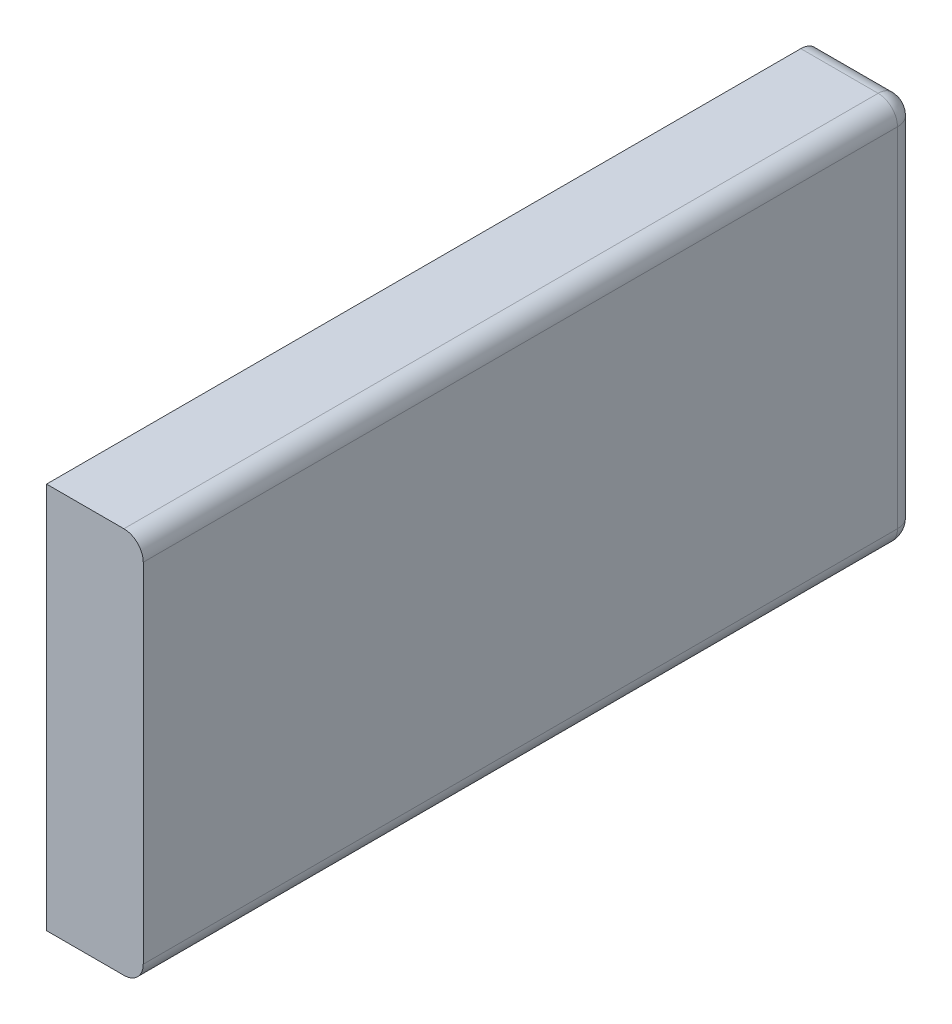
ISO-10303-21;
HEADER;
FILE_DESCRIPTION(('STEP AP214'),'2;1');
FILE_NAME('part.step','',(''),(''),'','','');
FILE_SCHEMA(('AUTOMOTIVE_DESIGN { 1 0 10303 214 1 1 1 1 }'));
ENDSEC;
DATA;
#1=APPLICATION_CONTEXT('core data for automotive mechanical design processes');
#2=APPLICATION_PROTOCOL_DEFINITION('international standard','automotive_design',2000,#1);
#3=PRODUCT_CONTEXT('',#1,'mechanical');
#4=PRODUCT('Part','Part','',(#3));
#5=PRODUCT_RELATED_PRODUCT_CATEGORY('part','',(#4));
#6=PRODUCT_DEFINITION_FORMATION('','',#4);
#7=PRODUCT_DEFINITION_CONTEXT('part definition',#1,'design');
#8=PRODUCT_DEFINITION('design','',#6,#7);
#9=PRODUCT_DEFINITION_SHAPE('','',#8);
#10=(LENGTH_UNIT() NAMED_UNIT(*) SI_UNIT(.MILLI.,.METRE.));
#11=(NAMED_UNIT(*) PLANE_ANGLE_UNIT() SI_UNIT($,.RADIAN.));
#12=(NAMED_UNIT(*) SI_UNIT($,.STERADIAN.) SOLID_ANGLE_UNIT());
#13=UNCERTAINTY_MEASURE_WITH_UNIT(LENGTH_MEASURE(1.E-05),#10,'distance_accuracy_value','');
#14=(GEOMETRIC_REPRESENTATION_CONTEXT(3) GLOBAL_UNCERTAINTY_ASSIGNED_CONTEXT((#13)) GLOBAL_UNIT_ASSIGNED_CONTEXT((#10,
#11,#12)) REPRESENTATION_CONTEXT('',''));
#15=CARTESIAN_POINT('',(0.,0.,0.));
#16=DIRECTION('',(0.,0.,1.));
#17=DIRECTION('',(1.,0.,0.));
#18=AXIS2_PLACEMENT_3D('',#15,#16,#17);
#19=CARTESIAN_POINT('',(12.7,50.8,0.));
#20=DIRECTION('',(0.,0.,-1.));
#21=DIRECTION('',(-1.,0.,0.));
#22=AXIS2_PLACEMENT_3D('',#19,#20,#21);
#23=PLANE('',#22);
#24=DIRECTION('',(1.,0.,0.));
#25=VECTOR('',#24,1.);
#26=CARTESIAN_POINT('',(12.7,0.,0.));
#27=LINE('',#26,#25);
#28=CARTESIAN_POINT('',(0.,0.,0.));
#29=VERTEX_POINT('',#28);
#30=CARTESIAN_POINT('',(10.16,0.,0.));
#31=VERTEX_POINT('',#30);
#32=EDGE_CURVE('E126',#29,#31,#27,.T.);
#33=ORIENTED_EDGE('',*,*,#32,.T.);
#34=CARTESIAN_POINT('',(10.16,2.54,0.));
#35=DIRECTION('',(0.,0.,-1.));
#36=DIRECTION('',(-1.,0.,0.));
#37=AXIS2_PLACEMENT_3D('',#34,#35,#36);
#38=CIRCLE('',#37,2.54);
#39=CARTESIAN_POINT('',(12.7,2.54,0.));
#40=VERTEX_POINT('',#39);
#41=EDGE_CURVE('E153',#31,#40,#38,.F.);
#42=ORIENTED_EDGE('',*,*,#41,.T.);
#43=DIRECTION('',(0.,-1.,0.));
#44=VECTOR('',#43,1.);
#45=CARTESIAN_POINT('',(12.7,50.8,0.));
#46=LINE('',#45,#44);
#47=CARTESIAN_POINT('',(12.7,48.26,0.));
#48=VERTEX_POINT('',#47);
#49=EDGE_CURVE('E132',#48,#40,#46,.T.);
#50=ORIENTED_EDGE('',*,*,#49,.F.);
#51=CARTESIAN_POINT('',(10.16,48.26,0.));
#52=DIRECTION('',(0.,0.,-1.));
#53=DIRECTION('',(-1.,0.,0.));
#54=AXIS2_PLACEMENT_3D('',#51,#52,#53);
#55=CIRCLE('',#54,2.54);
#56=CARTESIAN_POINT('',(10.16,50.8,0.));
#57=VERTEX_POINT('',#56);
#58=EDGE_CURVE('E124',#48,#57,#55,.F.);
#59=ORIENTED_EDGE('',*,*,#58,.T.);
#60=DIRECTION('',(1.,0.,0.));
#61=VECTOR('',#60,1.);
#62=CARTESIAN_POINT('',(12.7,50.8,0.));
#63=LINE('',#62,#61);
#64=CARTESIAN_POINT('',(0.,50.8,0.));
#65=VERTEX_POINT('',#64);
#66=EDGE_CURVE('E108',#65,#57,#63,.T.);
#67=ORIENTED_EDGE('',*,*,#66,.F.);
#68=DIRECTION('',(0.,-1.,0.));
#69=VECTOR('',#68,1.);
#70=CARTESIAN_POINT('',(0.,50.8,0.));
#71=LINE('',#70,#69);
#72=EDGE_CURVE('E111',#65,#29,#71,.T.);
#73=ORIENTED_EDGE('',*,*,#72,.T.);
#74=EDGE_LOOP('',(#33,#42,#50,#59,#67,#73));
#75=FACE_BOUND('',#74,.T.);
#76=ADVANCED_FACE('F42',(#75),#23,.F.);
#77=CARTESIAN_POINT('',(12.7,50.8,-101.6));
#78=DIRECTION('',(-1.,0.,0.));
#79=DIRECTION('',(0.,0.,1.));
#80=AXIS2_PLACEMENT_3D('',#77,#78,#79);
#81=PLANE('',#80);
#82=ORIENTED_EDGE('',*,*,#49,.T.);
#83=DIRECTION('',(0.,0.,-1.));
#84=VECTOR('',#83,1.);
#85=CARTESIAN_POINT('',(12.7,2.54,-101.6));
#86=LINE('',#85,#84);
#87=CARTESIAN_POINT('',(12.7,2.54,-99.06));
#88=VERTEX_POINT('',#87);
#89=EDGE_CURVE('E146',#40,#88,#86,.T.);
#90=ORIENTED_EDGE('',*,*,#89,.T.);
#91=DIRECTION('',(0.,-1.,0.));
#92=VECTOR('',#91,1.);
#93=CARTESIAN_POINT('',(12.7,50.8,-99.06));
#94=LINE('',#93,#92);
#95=CARTESIAN_POINT('',(12.7,48.26,-99.06));
#96=VERTEX_POINT('',#95);
#97=EDGE_CURVE('E144',#88,#96,#94,.F.);
#98=ORIENTED_EDGE('',*,*,#97,.T.);
#99=DIRECTION('',(0.,0.,-1.));
#100=VECTOR('',#99,1.);
#101=CARTESIAN_POINT('',(12.7,48.26,-101.6));
#102=LINE('',#101,#100);
#103=EDGE_CURVE('E142',#96,#48,#102,.F.);
#104=ORIENTED_EDGE('',*,*,#103,.T.);
#105=EDGE_LOOP('',(#82,#90,#98,#104));
#106=FACE_BOUND('',#105,.T.);
#107=ADVANCED_FACE('F204',(#106),#81,.F.);
#108=CARTESIAN_POINT('',(0.,50.8,-101.6));
#109=DIRECTION('',(0.,0.,1.));
#110=DIRECTION('',(1.,0.,0.));
#111=AXIS2_PLACEMENT_3D('',#108,#109,#110);
#112=PLANE('',#111);
#113=DIRECTION('',(0.,-1.,0.));
#114=VECTOR('',#113,1.);
#115=CARTESIAN_POINT('',(0.,50.8,-101.6));
#116=LINE('',#115,#114);
#117=CARTESIAN_POINT('',(0.,48.26,-101.6));
#118=VERTEX_POINT('',#117);
#119=CARTESIAN_POINT('',(0.,2.54,-101.6));
#120=VERTEX_POINT('',#119);
#121=EDGE_CURVE('E120',#118,#120,#116,.T.);
#122=ORIENTED_EDGE('',*,*,#121,.F.);
#123=DIRECTION('',(-1.,0.,0.));
#124=VECTOR('',#123,1.);
#125=CARTESIAN_POINT('',(0.,48.26,-101.6));
#126=LINE('',#125,#124);
#127=CARTESIAN_POINT('',(10.16,48.26,-101.6));
#128=VERTEX_POINT('',#127);
#129=EDGE_CURVE('E140',#118,#128,#126,.F.);
#130=ORIENTED_EDGE('',*,*,#129,.T.);
#131=DIRECTION('',(0.,-1.,0.));
#132=VECTOR('',#131,1.);
#133=CARTESIAN_POINT('',(10.16,50.8,-101.6));
#134=LINE('',#133,#132);
#135=CARTESIAN_POINT('',(10.16,2.54,-101.6));
#136=VERTEX_POINT('',#135);
#137=EDGE_CURVE('E137',#128,#136,#134,.T.);
#138=ORIENTED_EDGE('',*,*,#137,.T.);
#139=DIRECTION('',(-1.,0.,0.));
#140=VECTOR('',#139,1.);
#141=CARTESIAN_POINT('',(0.,2.54,-101.6));
#142=LINE('',#141,#140);
#143=EDGE_CURVE('E135',#136,#120,#142,.T.);
#144=ORIENTED_EDGE('',*,*,#143,.T.);
#145=EDGE_LOOP('',(#122,#130,#138,#144));
#146=FACE_BOUND('',#145,.T.);
#147=ADVANCED_FACE('F185',(#146),#112,.F.);
#148=CARTESIAN_POINT('',(0.,50.8,0.));
#149=DIRECTION('',(1.,0.,0.));
#150=DIRECTION('',(0.,0.,-1.));
#151=AXIS2_PLACEMENT_3D('',#148,#149,#150);
#152=PLANE('',#151);
#153=DIRECTION('',(0.,0.,1.));
#154=VECTOR('',#153,1.);
#155=CARTESIAN_POINT('',(0.,50.8,0.));
#156=LINE('',#155,#154);
#157=CARTESIAN_POINT('',(0.,50.8,-99.06));
#158=VERTEX_POINT('',#157);
#159=EDGE_CURVE('E104',#158,#65,#156,.T.);
#160=ORIENTED_EDGE('',*,*,#159,.F.);
#161=CARTESIAN_POINT('',(0.,48.26,-99.06));
#162=DIRECTION('',(1.,0.,0.));
#163=DIRECTION('',(0.,0.,-1.));
#164=AXIS2_PLACEMENT_3D('',#161,#162,#163);
#165=CIRCLE('',#164,2.54);
#166=EDGE_CURVE('E11',#158,#118,#165,.F.);
#167=ORIENTED_EDGE('',*,*,#166,.T.);
#168=ORIENTED_EDGE('',*,*,#121,.T.);
#169=CARTESIAN_POINT('',(0.,2.54,-99.06));
#170=DIRECTION('',(1.,0.,0.));
#171=DIRECTION('',(0.,0.,-1.));
#172=AXIS2_PLACEMENT_3D('',#169,#170,#171);
#173=CIRCLE('',#172,2.54);
#174=CARTESIAN_POINT('',(0.,0.,-99.06));
#175=VERTEX_POINT('',#174);
#176=EDGE_CURVE('E51',#120,#175,#173,.F.);
#177=ORIENTED_EDGE('',*,*,#176,.T.);
#178=DIRECTION('',(0.,0.,1.));
#179=VECTOR('',#178,1.);
#180=CARTESIAN_POINT('',(0.,0.,0.));
#181=LINE('',#180,#179);
#182=EDGE_CURVE('E116',#175,#29,#181,.T.);
#183=ORIENTED_EDGE('',*,*,#182,.T.);
#184=ORIENTED_EDGE('',*,*,#72,.F.);
#185=EDGE_LOOP('',(#160,#167,#168,#177,#183,#184));
#186=FACE_BOUND('',#185,.T.);
#187=ADVANCED_FACE('F114',(#186),#152,.F.);
#188=CARTESIAN_POINT('',(0.,50.8,0.));
#189=DIRECTION('',(0.,-1.,0.));
#190=DIRECTION('',(0.,0.,-1.));
#191=AXIS2_PLACEMENT_3D('',#188,#189,#190);
#192=PLANE('',#191);
#193=ORIENTED_EDGE('',*,*,#66,.T.);
#194=DIRECTION('',(0.,0.,-1.));
#195=VECTOR('',#194,1.);
#196=CARTESIAN_POINT('',(10.16,50.8,0.));
#197=LINE('',#196,#195);
#198=CARTESIAN_POINT('',(10.16,50.8,-99.06));
#199=VERTEX_POINT('',#198);
#200=EDGE_CURVE('E59',#57,#199,#197,.T.);
#201=ORIENTED_EDGE('',*,*,#200,.T.);
#202=DIRECTION('',(-1.,0.,0.));
#203=VECTOR('',#202,1.);
#204=CARTESIAN_POINT('',(0.,50.8,-99.06));
#205=LINE('',#204,#203);
#206=EDGE_CURVE('E63',#199,#158,#205,.T.);
#207=ORIENTED_EDGE('',*,*,#206,.T.);
#208=ORIENTED_EDGE('',*,*,#159,.T.);
#209=EDGE_LOOP('',(#193,#201,#207,#208));
#210=FACE_BOUND('',#209,.T.);
#211=ADVANCED_FACE('F106',(#210),#192,.F.);
#212=CARTESIAN_POINT('',(0.,0.,0.));
#213=DIRECTION('',(0.,-1.,0.));
#214=DIRECTION('',(0.,0.,-1.));
#215=AXIS2_PLACEMENT_3D('',#212,#213,#214);
#216=PLANE('',#215);
#217=DIRECTION('',(-1.,0.,0.));
#218=VECTOR('',#217,1.);
#219=CARTESIAN_POINT('',(12.7,0.,-99.06));
#220=LINE('',#219,#218);
#221=CARTESIAN_POINT('',(10.16,0.,-99.06));
#222=VERTEX_POINT('',#221);
#223=EDGE_CURVE('E148',#175,#222,#220,.F.);
#224=ORIENTED_EDGE('',*,*,#223,.T.);
#225=DIRECTION('',(0.,0.,-1.));
#226=VECTOR('',#225,1.);
#227=CARTESIAN_POINT('',(10.16,0.,0.));
#228=LINE('',#227,#226);
#229=EDGE_CURVE('E150',#222,#31,#228,.F.);
#230=ORIENTED_EDGE('',*,*,#229,.T.);
#231=ORIENTED_EDGE('',*,*,#32,.F.);
#232=ORIENTED_EDGE('',*,*,#182,.F.);
#233=EDGE_LOOP('',(#224,#230,#231,#232));
#234=FACE_BOUND('',#233,.T.);
#235=ADVANCED_FACE('F197',(#234),#216,.T.);
#236=CARTESIAN_POINT('',(10.16,48.26,0.));
#237=DIRECTION('',(0.,0.,-1.));
#238=DIRECTION('',(-1.,0.,0.));
#239=AXIS2_PLACEMENT_3D('',#236,#237,#238);
#240=CYLINDRICAL_SURFACE('',#239,2.54);
#241=ORIENTED_EDGE('',*,*,#58,.F.);
#242=ORIENTED_EDGE('',*,*,#103,.F.);
#243=CARTESIAN_POINT('',(10.16,48.26,-99.06));
#244=DIRECTION('',(0.,0.,-1.));
#245=DIRECTION('',(-1.,0.,0.));
#246=AXIS2_PLACEMENT_3D('',#243,#244,#245);
#247=CIRCLE('',#246,2.54);
#248=EDGE_CURVE('E46',#199,#96,#247,.T.);
#249=ORIENTED_EDGE('',*,*,#248,.F.);
#250=ORIENTED_EDGE('',*,*,#200,.F.);
#251=EDGE_LOOP('',(#241,#242,#249,#250));
#252=FACE_BOUND('',#251,.T.);
#253=ADVANCED_FACE('F44',(#252),#240,.T.);
#254=CARTESIAN_POINT('',(0.,48.26,-99.06));
#255=DIRECTION('',(-1.,0.,0.));
#256=DIRECTION('',(0.,0.,1.));
#257=AXIS2_PLACEMENT_3D('',#254,#255,#256);
#258=CYLINDRICAL_SURFACE('',#257,2.54);
#259=ORIENTED_EDGE('',*,*,#166,.F.);
#260=ORIENTED_EDGE('',*,*,#206,.F.);
#261=CARTESIAN_POINT('',(10.16,48.26,-99.06));
#262=DIRECTION('',(1.,0.,0.));
#263=DIRECTION('',(0.,0.,-1.));
#264=AXIS2_PLACEMENT_3D('',#261,#262,#263);
#265=CIRCLE('',#264,2.54);
#266=EDGE_CURVE('E168',#128,#199,#265,.T.);
#267=ORIENTED_EDGE('',*,*,#266,.F.);
#268=ORIENTED_EDGE('',*,*,#129,.F.);
#269=EDGE_LOOP('',(#259,#260,#267,#268));
#270=FACE_BOUND('',#269,.T.);
#271=ADVANCED_FACE('F189',(#270),#258,.T.);
#272=CARTESIAN_POINT('',(0.,2.54,-99.06));
#273=DIRECTION('',(1.,0.,0.));
#274=DIRECTION('',(0.,0.,-1.));
#275=AXIS2_PLACEMENT_3D('',#272,#273,#274);
#276=CYLINDRICAL_SURFACE('',#275,2.54);
#277=ORIENTED_EDGE('',*,*,#176,.F.);
#278=ORIENTED_EDGE('',*,*,#143,.F.);
#279=CARTESIAN_POINT('',(10.16,2.54,-99.06));
#280=DIRECTION('',(1.,0.,0.));
#281=DIRECTION('',(0.,0.,-1.));
#282=AXIS2_PLACEMENT_3D('',#279,#280,#281);
#283=CIRCLE('',#282,2.54);
#284=EDGE_CURVE('E166',#222,#136,#283,.T.);
#285=ORIENTED_EDGE('',*,*,#284,.F.);
#286=ORIENTED_EDGE('',*,*,#223,.F.);
#287=EDGE_LOOP('',(#277,#278,#285,#286));
#288=FACE_BOUND('',#287,.T.);
#289=ADVANCED_FACE('F193',(#288),#276,.T.);
#290=CARTESIAN_POINT('',(10.16,2.54,-101.6));
#291=DIRECTION('',(0.,0.,1.));
#292=DIRECTION('',(1.,0.,0.));
#293=AXIS2_PLACEMENT_3D('',#290,#291,#292);
#294=CYLINDRICAL_SURFACE('',#293,2.54);
#295=ORIENTED_EDGE('',*,*,#41,.F.);
#296=ORIENTED_EDGE('',*,*,#229,.F.);
#297=CARTESIAN_POINT('',(10.16,2.54,-99.06));
#298=DIRECTION('',(0.,0.,-1.));
#299=DIRECTION('',(-1.,0.,0.));
#300=AXIS2_PLACEMENT_3D('',#297,#298,#299);
#301=CIRCLE('',#300,2.54);
#302=EDGE_CURVE('E163',#88,#222,#301,.T.);
#303=ORIENTED_EDGE('',*,*,#302,.F.);
#304=ORIENTED_EDGE('',*,*,#89,.F.);
#305=EDGE_LOOP('',(#295,#296,#303,#304));
#306=FACE_BOUND('',#305,.T.);
#307=ADVANCED_FACE('F201',(#306),#294,.T.);
#308=CARTESIAN_POINT('',(10.16,48.26,-99.06));
#309=DIRECTION('',(0.,1.,0.));
#310=DIRECTION('',(0.,0.,1.));
#311=AXIS2_PLACEMENT_3D('',#308,#309,#310);
#312=SPHERICAL_SURFACE('',#311,2.54);
#313=ORIENTED_EDGE('',*,*,#266,.T.);
#314=ORIENTED_EDGE('',*,*,#248,.T.);
#315=CARTESIAN_POINT('',(10.16,48.26,-99.06));
#316=DIRECTION('',(0.,1.,0.));
#317=DIRECTION('',(0.,0.,1.));
#318=AXIS2_PLACEMENT_3D('',#315,#316,#317);
#319=CIRCLE('',#318,2.54);
#320=EDGE_CURVE('E160',#128,#96,#319,.F.);
#321=ORIENTED_EDGE('',*,*,#320,.F.);
#322=EDGE_LOOP('',(#313,#314,#321));
#323=FACE_BOUND('',#322,.T.);
#324=ADVANCED_FACE('F175',(#323),#312,.T.);
#325=CARTESIAN_POINT('',(10.16,2.54,-99.06));
#326=DIRECTION('',(0.,-1.,0.));
#327=DIRECTION('',(0.,0.,-1.));
#328=AXIS2_PLACEMENT_3D('',#325,#326,#327);
#329=SPHERICAL_SURFACE('',#328,2.54);
#330=ORIENTED_EDGE('',*,*,#302,.T.);
#331=ORIENTED_EDGE('',*,*,#284,.T.);
#332=CARTESIAN_POINT('',(10.16,2.54,-99.06));
#333=DIRECTION('',(0.,-1.,0.));
#334=DIRECTION('',(0.,0.,-1.));
#335=AXIS2_PLACEMENT_3D('',#332,#333,#334);
#336=CIRCLE('',#335,2.54);
#337=EDGE_CURVE('E158',#88,#136,#336,.F.);
#338=ORIENTED_EDGE('',*,*,#337,.F.);
#339=EDGE_LOOP('',(#330,#331,#338));
#340=FACE_BOUND('',#339,.T.);
#341=ADVANCED_FACE('F221',(#340),#329,.T.);
#342=CARTESIAN_POINT('',(10.16,50.8,-99.06));
#343=DIRECTION('',(0.,-1.,0.));
#344=DIRECTION('',(0.,0.,-1.));
#345=AXIS2_PLACEMENT_3D('',#342,#343,#344);
#346=CYLINDRICAL_SURFACE('',#345,2.54);
#347=ORIENTED_EDGE('',*,*,#320,.T.);
#348=ORIENTED_EDGE('',*,*,#97,.F.);
#349=ORIENTED_EDGE('',*,*,#337,.T.);
#350=ORIENTED_EDGE('',*,*,#137,.F.);
#351=EDGE_LOOP('',(#347,#348,#349,#350));
#352=FACE_BOUND('',#351,.T.);
#353=ADVANCED_FACE('F181',(#352),#346,.T.);
#354=CLOSED_SHELL('',(#76,#107,#147,#187,#211,#235,#253,#271,#289,#307,#324,#341,#353));
#355=MANIFOLD_SOLID_BREP('B2',#354);
#356=ADVANCED_BREP_SHAPE_REPRESENTATION('',(#18,#355),#14);
#357=SHAPE_DEFINITION_REPRESENTATION(#9,#356);
ENDSEC;
END-ISO-10303-21;
